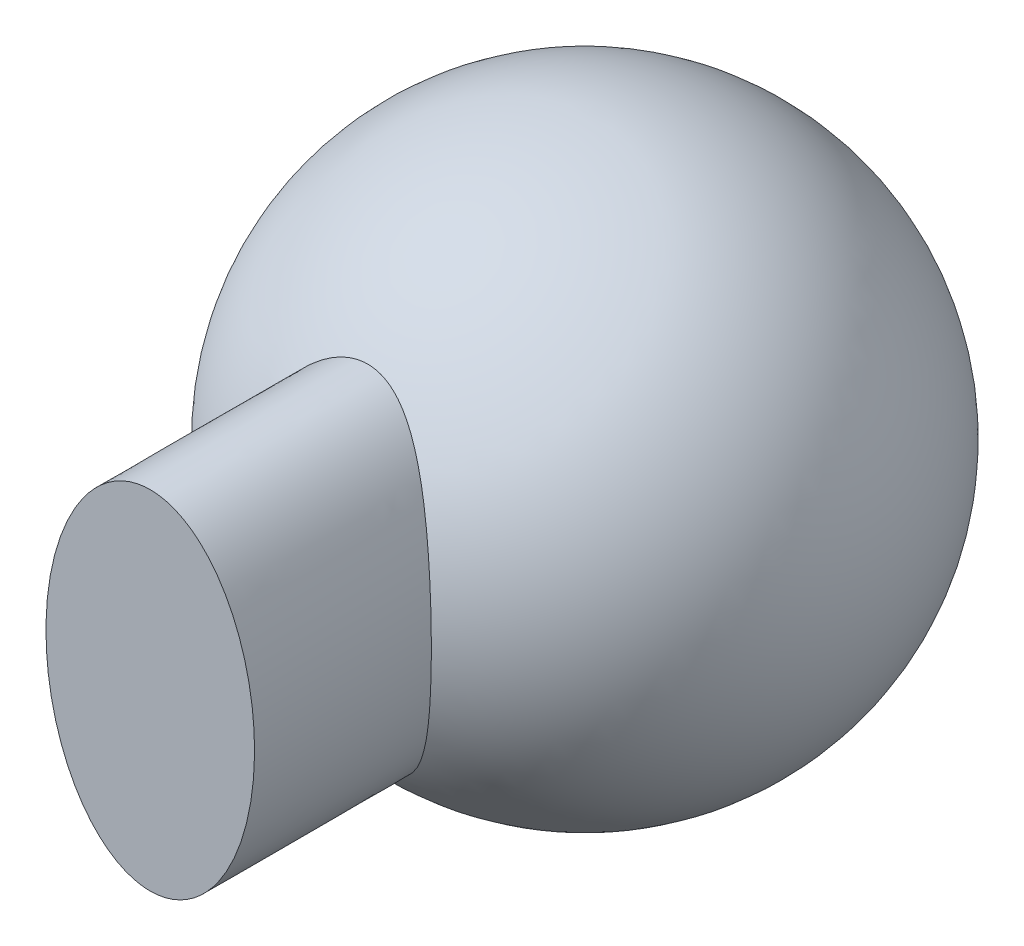
ISO-10303-21;
HEADER;
FILE_DESCRIPTION(('STEP AP214'),'2;1');
FILE_NAME('part.step','',(''),(''),'','','');
FILE_SCHEMA(('AUTOMOTIVE_DESIGN { 1 0 10303 214 1 1 1 1 }'));
ENDSEC;
DATA;
#1=APPLICATION_CONTEXT('core data for automotive mechanical design processes');
#2=APPLICATION_PROTOCOL_DEFINITION('international standard','automotive_design',2000,#1);
#3=PRODUCT_CONTEXT('',#1,'mechanical');
#4=PRODUCT('Part','Part','',(#3));
#5=PRODUCT_RELATED_PRODUCT_CATEGORY('part','',(#4));
#6=PRODUCT_DEFINITION_FORMATION('','',#4);
#7=PRODUCT_DEFINITION_CONTEXT('part definition',#1,'design');
#8=PRODUCT_DEFINITION('design','',#6,#7);
#9=PRODUCT_DEFINITION_SHAPE('','',#8);
#10=(LENGTH_UNIT() NAMED_UNIT(*) SI_UNIT(.MILLI.,.METRE.));
#11=(NAMED_UNIT(*) PLANE_ANGLE_UNIT() SI_UNIT($,.RADIAN.));
#12=(NAMED_UNIT(*) SI_UNIT($,.STERADIAN.) SOLID_ANGLE_UNIT());
#13=UNCERTAINTY_MEASURE_WITH_UNIT(LENGTH_MEASURE(1.E-05),#10,'distance_accuracy_value','');
#14=(GEOMETRIC_REPRESENTATION_CONTEXT(3) GLOBAL_UNCERTAINTY_ASSIGNED_CONTEXT((#13)) GLOBAL_UNIT_ASSIGNED_CONTEXT((#10,
#11,#12)) REPRESENTATION_CONTEXT('',''));
#15=CARTESIAN_POINT('',(0.,0.,0.));
#16=DIRECTION('',(0.,0.,1.));
#17=DIRECTION('',(1.,0.,0.));
#18=AXIS2_PLACEMENT_3D('',#15,#16,#17);
#19=CARTESIAN_POINT('',(0.,0.,19.84375));
#20=DIRECTION('',(0.,0.,1.));
#21=DIRECTION('',(0.,-1.,0.));
#22=AXIS2_PLACEMENT_3D('',#19,#20,#21);
#23=ELLIPSE('',#22,7.9375,4.7625);
#24=DIRECTION('',(0.,0.,-1.));
#25=VECTOR('',#24,1.);
#26=SURFACE_OF_LINEAR_EXTRUSION('',#23,#25);
#27=CARTESIAN_POINT('',(0.,-7.9375,9.91393432245746));
#28=CARTESIAN_POINT('',(-0.0788271013535129,-7.93749939305309,9.91393473412998));
#29=CARTESIAN_POINT('',(-0.157660724959963,-7.93423018182998,9.91561130271447));
#30=CARTESIAN_POINT('',(-0.314684303138368,-7.92123813340423,9.92225689652768));
#31=CARTESIAN_POINT('',(-0.392873930252473,-7.91151219622446,9.92722750327466));
#32=CARTESIAN_POINT('',(-0.547108536920799,-7.88599628406234,9.94021217946963));
#33=CARTESIAN_POINT('',(-0.623167628856981,-7.87027392914492,9.94819230055361));
#34=CARTESIAN_POINT('',(-0.773542638782759,-7.83312498063421,9.9669392108722));
#35=CARTESIAN_POINT('',(-0.847857833356806,-7.81169606378065,9.97770713502977));
#36=CARTESIAN_POINT('',(-1.06783476654783,-7.7394133760856,10.0137717045932));
#37=CARTESIAN_POINT('',(-1.21030495094333,-7.68060248221051,10.0428089036473));
#38=CARTESIAN_POINT('',(-1.54726343172525,-7.51494937796682,10.1229055755407));
#39=CARTESIAN_POINT('',(-1.73598879628897,-7.3984237735311,10.1779773553932));
#40=CARTESIAN_POINT('',(-2.00212622143167,-7.20384219448494,10.2664116642236));
#41=CARTESIAN_POINT('',(-2.08810391167954,-7.13559163498631,10.2968998346285));
#42=CARTESIAN_POINT('',(-2.25468831540992,-6.99335625747456,10.3591643388172));
#43=CARTESIAN_POINT('',(-2.33529603089741,-6.91937251484369,10.3909404304928));
#44=CARTESIAN_POINT('',(-2.53682775972689,-6.72194870099306,10.4738903499377));
#45=CARTESIAN_POINT('',(-2.65389862842513,-6.59479433997214,10.5255859097498));
#46=CARTESIAN_POINT('',(-2.87605598622511,-6.33076464307304,10.6288350686593));
#47=CARTESIAN_POINT('',(-2.98115652503119,-6.19390101589774,10.6803887634089));
#48=CARTESIAN_POINT('',(-3.20947387279228,-5.87110442708068,10.7969122412572));
#49=CARTESIAN_POINT('',(-3.32909047084653,-5.68246219145526,10.8614312611221));
#50=CARTESIAN_POINT('',(-3.55197522256664,-5.29435174576013,10.9862343068103));
#51=CARTESIAN_POINT('',(-3.65523271291553,-5.09487658729803,11.0465155562159));
#52=CARTESIAN_POINT('',(-3.84642079359177,-4.68759352859872,11.1613315539746));
#53=CARTESIAN_POINT('',(-3.93437703061895,-4.47980030396229,11.2158758562339));
#54=CARTESIAN_POINT('',(-4.09608842507793,-4.05725122448623,11.3183287173818));
#55=CARTESIAN_POINT('',(-4.16984657411839,-3.84249684756313,11.3662386735621));
#56=CARTESIAN_POINT('',(-4.30383825680392,-3.40746299814802,11.4546891698553));
#57=CARTESIAN_POINT('',(-4.36407851621658,-3.18718633416882,11.4952333728463));
#58=CARTESIAN_POINT('',(-4.4715804749601,-2.74220261492957,11.568449699945));
#59=CARTESIAN_POINT('',(-4.51884162917925,-2.51749537401362,11.6011214934111));
#60=CARTESIAN_POINT('',(-4.60071912447829,-2.06484896308331,11.658193458756));
#61=CARTESIAN_POINT('',(-4.63534033569729,-1.83691107307013,11.6825968161818));
#62=CARTESIAN_POINT('',(-4.69220851621079,-1.37870076429045,11.7228870055865));
#63=CARTESIAN_POINT('',(-4.71445263435496,-1.14842782005662,11.7387718752415));
#64=CARTESIAN_POINT('',(-4.74669587519764,-0.68664247924534,11.7618490927025));
#65=CARTESIAN_POINT('',(-4.75669750975929,-0.455130346713433,11.7690432236351));
#66=CARTESIAN_POINT('',(-4.76452710492962,0.00820617764960818,11.7746722992924));
#67=CARTESIAN_POINT('',(-4.7623550323927,0.240030570329222,11.7731072201681));
#68=CARTESIAN_POINT('',(-4.74582247971294,0.703051549770778,11.7612327220086));
#69=CARTESIAN_POINT('',(-4.73146039444439,0.934248049832531,11.7509221514068));
#70=CARTESIAN_POINT('',(-4.69045898457885,1.39495079661604,11.7216633038144));
#71=CARTESIAN_POINT('',(-4.66382238842379,1.6244574074624,11.7027169464415));
#72=CARTESIAN_POINT('',(-4.59808809922057,2.08088375269606,11.6563810885626));
#73=CARTESIAN_POINT('',(-4.55898723257359,2.30780281299469,11.6289894378106));
#74=CARTESIAN_POINT('',(-4.46804978724304,2.75793932931822,11.5660716569667));
#75=CARTESIAN_POINT('',(-4.41621318762835,2.98115677925889,11.5305455135058));
#76=CARTESIAN_POINT('',(-4.29938442369564,3.42283140560263,11.4517801654059));
#77=CARTESIAN_POINT('',(-4.23438776119521,3.64128692599557,11.4085383241005));
#78=CARTESIAN_POINT('',(-4.09068888384063,4.07210760243689,11.3149438849024));
#79=CARTESIAN_POINT('',(-4.01198636248485,4.28447262216079,11.2645911279944));
#80=CARTESIAN_POINT('',(-3.84004392378339,4.70182024355113,11.1575443848452));
#81=CARTESIAN_POINT('',(-3.74679226086621,4.90679671437375,11.1008452857238));
#82=CARTESIAN_POINT('',(-3.54474437414306,5.30745238800261,10.9822389366736));
#83=CARTESIAN_POINT('',(-3.43594757779432,5.5031312480147,10.9203314949509));
#84=CARTESIAN_POINT('',(-3.2251363223459,5.84449215961342,10.8057724475526));
#85=CARTESIAN_POINT('',(-3.12619012276718,5.99228990922115,10.7537767880283));
#86=CARTESIAN_POINT('',(-2.91670302100292,6.2788446322726,10.648622600598));
#87=CARTESIAN_POINT('',(-2.80617337043878,6.41761017058406,10.5954652401279));
#88=CARTESIAN_POINT('',(-2.59902944772443,6.65382287687148,10.5015294782161));
#89=CARTESIAN_POINT('',(-2.50497225563098,6.75348665321523,10.46068681265));
#90=CARTESIAN_POINT('',(-2.30853260265671,6.94523551299954,10.3800229167656));
#91=CARTESIAN_POINT('',(-2.20613350665162,7.03730467789853,10.3402039465814));
#92=CARTESIAN_POINT('',(-2.01414727692478,7.19445031512042,10.2706476375617));
#93=CARTESIAN_POINT('',(-1.92611315736618,7.26123573921094,10.2404907781185));
#94=CARTESIAN_POINT('',(-1.74433271355236,7.38775475576258,10.1824106952534));
#95=CARTESIAN_POINT('',(-1.65058464815131,7.44748618228666,10.1544881587267));
#96=CARTESIAN_POINT('',(-1.45762344605667,7.55850035437991,10.1018543187044));
#97=CARTESIAN_POINT('',(-1.3584232524695,7.60980204605636,10.0771358411553));
#98=CARTESIAN_POINT('',(-1.15467540991781,7.70268016638467,10.0318726783303));
#99=CARTESIAN_POINT('',(-1.05013167403783,7.74426359083064,10.0113249920771));
#100=CARTESIAN_POINT('',(-0.873510960910133,7.80374878403274,9.9816856019121));
#101=CARTESIAN_POINT('',(-0.802755908899298,7.82486108376775,9.97109279035284));
#102=CARTESIAN_POINT('',(-0.659591420435303,7.86193142273762,9.95241295415753));
#103=CARTESIAN_POINT('',(-0.587182481045582,7.87789098931923,9.94432518701802));
#104=CARTESIAN_POINT('',(-0.441177975160888,7.90431592017841,9.9308960656105));
#105=CARTESIAN_POINT('',(-0.367583489791073,7.91478602714362,9.92555234067518));
#106=CARTESIAN_POINT('',(-0.219646920935581,7.93001556032705,9.9177695359867));
#107=CARTESIAN_POINT('',(-0.145304817755563,7.93477483570656,9.91533053295522));
#108=CARTESIAN_POINT('',(0.00373528103012565,7.93847161993563,9.91343657582343));
#109=CARTESIAN_POINT('',(0.0784337020846186,7.93739563875154,9.91398853627497));
#110=CARTESIAN_POINT('',(0.2274325539093,7.9294172836682,9.91807372464476));
#111=CARTESIAN_POINT('',(0.301732992673467,7.92251502724204,9.92160689245399));
#112=CARTESIAN_POINT('',(0.449432285789927,7.90304233756981,9.93154109014083));
#113=CARTESIAN_POINT('',(0.52283060012773,7.89046866439472,9.93794375927459));
#114=CARTESIAN_POINT('',(0.668215064680717,7.8599312622595,9.95341899898057));
#115=CARTESIAN_POINT('',(0.740200908612164,7.84196637772042,9.96249214194737));
#116=CARTESIAN_POINT('',(0.898463295831819,7.79636521620292,9.98538112822599));
#117=CARTESIAN_POINT('',(0.984287997039687,7.76746037331058,9.99980556964539));
#118=CARTESIAN_POINT('',(1.15271268481484,7.70283850793288,10.0317465574185));
#119=CARTESIAN_POINT('',(1.23531192969671,7.66711992963,10.0492638099026));
#120=CARTESIAN_POINT('',(1.47808335787528,7.55076053678616,10.1056851331913));
#121=CARTESIAN_POINT('',(1.63305014258907,7.46097030104384,10.1484308568614));
#122=CARTESIAN_POINT('',(1.89162401924568,7.28726987072631,10.2287154587594));
#123=CARTESIAN_POINT('',(1.9984626126685,7.2073852788682,10.2649325703333));
#124=CARTESIAN_POINT('',(2.20421134365836,7.03877956584885,10.3395407016619));
#125=CARTESIAN_POINT('',(2.3031170079644,6.95005352147741,10.3779329274003));
#126=CARTESIAN_POINT('',(2.49342108488979,6.76519016254414,10.4558212483157));
#127=CARTESIAN_POINT('',(2.58481164125012,6.66904529082397,10.4953184422543));
#128=CARTESIAN_POINT('',(2.76043182478113,6.47058912111415,10.5745268304224));
#129=CARTESIAN_POINT('',(2.84466311884697,6.36827926805344,10.6142379725359));
#130=CARTESIAN_POINT('',(3.05295092242441,6.09803786949131,10.7159139772374));
#131=CARTESIAN_POINT('',(3.17208392887683,5.92617636083623,10.7775558916957));
#132=CARTESIAN_POINT('',(3.39514513279735,5.57226888687692,10.8977124882492));
#133=CARTESIAN_POINT('',(3.49909260619557,5.39023624564572,10.9562310739938));
#134=CARTESIAN_POINT('',(3.69307052646564,5.0178821819833,11.0688423727738));
#135=CARTESIAN_POINT('',(3.78311559708366,4.8275697429046,11.1229397078688));
#136=CARTESIAN_POINT('',(3.95034413099329,4.43994005594057,11.2258155767223));
#137=CARTESIAN_POINT('',(4.0275237116374,4.24262071517225,11.274592503317));
#138=CARTESIAN_POINT('',(4.16962007068551,3.84242357587747,11.3660544099245));
#139=CARTESIAN_POINT('',(4.23454577710108,3.63954994849931,11.408743819635));
#140=CARTESIAN_POINT('',(4.35270650387042,3.2292044395069,11.487529052159));
#141=CARTESIAN_POINT('',(4.40594259313807,3.02173298023604,11.5236254777928));
#142=CARTESIAN_POINT('',(4.5010916347226,2.60320313486951,11.5888134886555));
#143=CARTESIAN_POINT('',(4.54300853668094,2.39214602732019,11.6179075168679));
#144=CARTESIAN_POINT('',(4.61581546214788,1.96725249091747,11.6688180480529));
#145=CARTESIAN_POINT('',(4.64670296470262,1.75341543822179,11.6906328871704));
#146=CARTESIAN_POINT('',(4.72308196130013,1.10918093827294,11.7448000821613));
#147=CARTESIAN_POINT('',(4.75235584004921,0.675765380653234,11.7659213436404));
#148=CARTESIAN_POINT('',(4.76822477404279,-0.192231597991191,11.7773311897605));
#149=CARTESIAN_POINT('',(4.75482081401513,-0.626812991884798,11.7676204858034));
#150=CARTESIAN_POINT('',(4.70251382892573,-1.27460140129378,11.7302581066043));
#151=CARTESIAN_POINT('',(4.67969928324044,-1.48991622506651,11.7139960329266));
#152=CARTESIAN_POINT('',(4.62318391904588,-1.91840248925205,11.6740292723805));
#153=CARTESIAN_POINT('',(4.58948530638791,-2.13157435495483,11.6503260936127));
#154=CARTESIAN_POINT('',(4.51098828956948,-2.55499194675845,11.5956945688432));
#155=CARTESIAN_POINT('',(4.46618659445648,-2.76523678573965,11.5647640808234));
#156=CARTESIAN_POINT('',(4.36519541170912,-3.18182524827514,11.4960066137004));
#157=CARTESIAN_POINT('',(4.3090065471192,-3.38816908459621,11.4581800119268));
#158=CARTESIAN_POINT('',(4.18481693137413,-3.79603189145863,11.376053477634));
#159=CARTESIAN_POINT('',(4.11681291569148,-3.99754951095989,11.3317517565771));
#160=CARTESIAN_POINT('',(3.96843593536461,-4.39463865874599,11.2372519596207));
#161=CARTESIAN_POINT('',(3.88805989958492,-4.5902086961737,11.1870524204265));
#162=CARTESIAN_POINT('',(3.71411953543524,-4.97426446671298,11.0814841507833));
#163=CARTESIAN_POINT('',(3.62054000591635,-5.16274171256244,11.0261094873916));
#164=CARTESIAN_POINT('',(3.4193678285946,-5.53062625845837,10.9113374739277));
#165=CARTESIAN_POINT('',(3.31178725193776,-5.71004118880905,10.8519436099851));
#166=CARTESIAN_POINT('',(3.10272028599408,-6.02553563285262,10.7418506848741));
#167=CARTESIAN_POINT('',(3.00381302755762,-6.16347484031843,10.6915855448858));
#168=CARTESIAN_POINT('',(2.79472876844718,-6.43089539275603,10.5903023310013));
#169=CARTESIAN_POINT('',(2.68452595974259,-6.56035620921533,10.539282771506));
#170=CARTESIAN_POINT('',(2.47765979633789,-6.78114004629618,10.4492338759317));
#171=CARTESIAN_POINT('',(2.38334481697012,-6.87459111738265,10.4100340149744));
#172=CARTESIAN_POINT('',(2.1868752381433,-7.05366888934383,10.3330771753189));
#173=CARTESIAN_POINT('',(2.08471733785494,-7.13929226221453,10.295320814268));
#174=CARTESIAN_POINT('',(1.87247012389397,-7.30084206164991,10.2225540339478));
#175=CARTESIAN_POINT('',(1.76240231792409,-7.37679333501954,10.1875366716175));
#176=CARTESIAN_POINT('',(1.53409949402204,-7.5171559200626,10.1216570932574));
#177=CARTESIAN_POINT('',(1.41587329442671,-7.5815794294392,10.0907904939415));
#178=CARTESIAN_POINT('',(1.15389482697123,-7.70478192184181,10.0309345464692));
#179=CARTESIAN_POINT('',(1.008905172538,-7.76145027967409,10.002838637881));
#180=CARTESIAN_POINT('',(0.785417326837084,-7.82983510148617,9.96860120204786));
#181=CARTESIAN_POINT('',(0.709991151281373,-7.84984989705843,9.95851197743692));
#182=CARTESIAN_POINT('',(0.557495590738796,-7.88396916067142,9.94124719781036));
#183=CARTESIAN_POINT('',(0.480426989486065,-7.89807638414593,9.93407028447118));
#184=CARTESIAN_POINT('',(0.336217907609483,-7.91847940692688,9.9236681997726));
#185=CARTESIAN_POINT('',(0.269222944917659,-7.92560038349327,9.92002638859698));
#186=CARTESIAN_POINT('',(0.134820194739467,-7.9351105209261,9.91515948772117));
#187=CARTESIAN_POINT('',(0.0674124824179741,-7.9375005190575,9.9139339703975));
#188=CARTESIAN_POINT('',(0.,-7.9375,9.91393432245746));
#189=B_SPLINE_CURVE_WITH_KNOTS('',3,(#27,#28,#29,#30,#31,#32,#33,#34,#35,#36,#37,#38,#39,#40,
#41,#42,#43,#44,#45,#46,#47,#48,#49,#50,#51,#52,#53,#54,#55,#56,#57,#58,#59,#60,#61,#62,#63,#64,
#65,#66,#67,#68,#69,#70,#71,#72,#73,#74,#75,#76,#77,#78,#79,#80,#81,#82,#83,#84,#85,#86,#87,#88,
#89,#90,#91,#92,#93,#94,#95,#96,#97,#98,#99,#100,#101,#102,#103,#104,#105,#106,#107,#108,#109,
#110,#111,#112,#113,#114,#115,#116,#117,#118,#119,#120,#121,#122,#123,#124,#125,#126,#127,#128,
#129,#130,#131,#132,#133,#134,#135,#136,#137,#138,#139,#140,#141,#142,#143,#144,#145,#146,#147,
#148,#149,#150,#151,#152,#153,#154,#155,#156,#157,#158,#159,#160,#161,#162,#163,#164,#165,#166,
#167,#168,#169,#170,#171,#172,#173,#174,#175,#176,#177,#178,#179,#180,#181,#182,#183,#184,#185,
#186,#187,#188),.UNSPECIFIED.,.T.,.F.,(4,2,2,2,2,2,2,2,2,2,2,2,2,2,2,2,2,2,2,2,2,2,2,2,2,2,2,2,
2,2,2,2,2,2,2,2,2,2,2,2,2,2,2,2,2,2,2,2,2,2,2,2,2,2,2,2,2,2,2,2,2,2,2,2,2,2,2,2,2,2,2,2,2,2,2,2,
2,2,2,2,4),(0.,0.236408292949557,0.472930171458575,0.706860150158566,0.940885512612896,
1.40960935668978,2.09121724821472,2.43281871995445,2.77435627134047,3.31475456819388,
3.85451191104948,4.55098737506331,5.24791496955979,5.94366293460601,6.63926414120026,
7.33451848324175,8.02980202092719,8.72481738414232,9.41999278281692,10.1150255243004,
10.8100601581648,11.5051863252455,12.2001580505575,12.8953068681017,13.590456828127,
14.2858447965973,14.9812483178993,15.6772161737714,16.3732096694445,16.9286321936733,
17.4835201210938,17.9121370581712,18.3416306949666,18.684929676914,19.0283337965878,
19.3709552227192,19.713329244339,19.9369004730088,20.1604053708699,20.3837168493362,
20.6070342259406,20.8308680907608,21.0546974426065,21.2786548244533,21.5026602447641,
21.7773496473629,22.0521018465363,22.6021667151498,23.0163661274468,23.4307974822097,
23.8456567149175,24.260419089592,24.913480868568,25.5657063356526,26.2172409916729,
26.8689719182986,27.520226153641,28.1714208126223,28.8223879536241,29.473503788968,
30.7748250467374,32.0761162786662,32.7271647762612,33.3780814099138,34.0291912064221,
34.6802653873314,35.3315197470206,35.9829360305882,36.6351085023318,37.2867223763443,
37.817313079305,38.3491443045308,38.7640756011086,39.1791824962761,39.5932005294911,
40.0067778594708,40.4792568780831,40.7150737486456,40.9507805057045,41.152991303736,
41.3551663123089),.UNSPECIFIED.);
#190=CARTESIAN_POINT('',(0.,-7.9375,9.91393432245746));
#191=VERTEX_POINT('',#190);
#192=EDGE_CURVE('E10',#191,#191,#189,.T.);
#193=ORIENTED_EDGE('',*,*,#192,.F.);
#194=EDGE_LOOP('',(#193));
#195=FACE_BOUND('',#194,.T.);
#196=CARTESIAN_POINT('',(0.,-7.9375,19.84375));
#197=VERTEX_POINT('',#196);
#198=EDGE_CURVE('E40',#197,#197,#23,.T.);
#199=ORIENTED_EDGE('',*,*,#198,.F.);
#200=EDGE_LOOP('',(#199));
#201=FACE_BOUND('',#200,.T.);
#202=ADVANCED_FACE('F30',(#195,#201),#26,.F.);
#203=CARTESIAN_POINT('',(0.,0.,19.84375));
#204=DIRECTION('',(0.,0.,1.));
#205=DIRECTION('',(1.,0.,0.));
#206=AXIS2_PLACEMENT_3D('',#203,#204,#205);
#207=PLANE('',#206);
#208=ORIENTED_EDGE('',*,*,#198,.T.);
#209=EDGE_LOOP('',(#208));
#210=FACE_BOUND('',#209,.T.);
#211=ADVANCED_FACE('F50',(#210),#207,.T.);
#212=CARTESIAN_POINT('',(0.,0.,0.));
#213=DIRECTION('',(0.,1.,0.));
#214=DIRECTION('',(1.,0.,0.));
#215=AXIS2_PLACEMENT_3D('',#212,#213,#214);
#216=SPHERICAL_SURFACE('',#215,12.7);
#217=ORIENTED_EDGE('',*,*,#192,.T.);
#218=EDGE_LOOP('',(#217));
#219=FACE_BOUND('',#218,.T.);
#220=ADVANCED_FACE('F32',(#219),#216,.T.);
#221=CLOSED_SHELL('',(#202,#211,#220));
#222=MANIFOLD_SOLID_BREP('B2',#221);
#223=ADVANCED_BREP_SHAPE_REPRESENTATION('',(#18,#222),#14);
#224=SHAPE_DEFINITION_REPRESENTATION(#9,#223);
ENDSEC;
END-ISO-10303-21;
